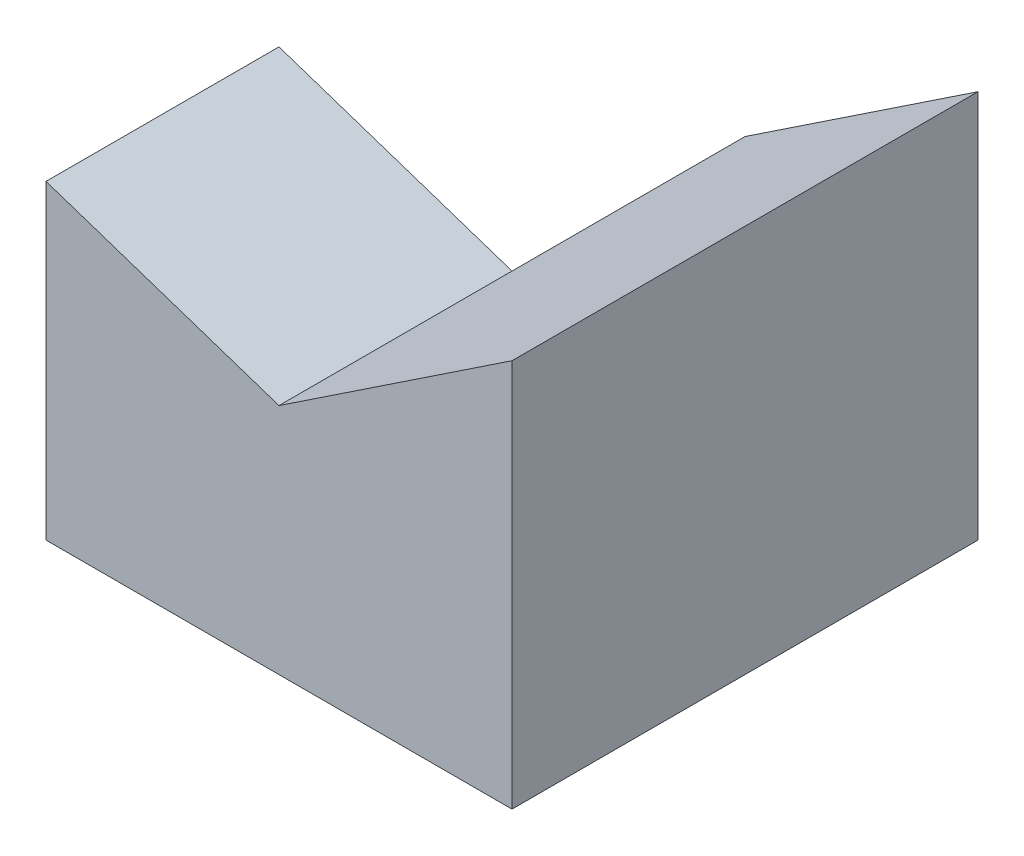
ISO-10303-21;
HEADER;
FILE_DESCRIPTION(('STEP AP214'),'2;1');
FILE_NAME('part.step','',(''),(''),'','','');
FILE_SCHEMA(('AUTOMOTIVE_DESIGN { 1 0 10303 214 1 1 1 1 }'));
ENDSEC;
DATA;
#1=APPLICATION_CONTEXT('core data for automotive mechanical design processes');
#2=APPLICATION_PROTOCOL_DEFINITION('international standard','automotive_design',2000,#1);
#3=PRODUCT_CONTEXT('',#1,'mechanical');
#4=PRODUCT('Part','Part','',(#3));
#5=PRODUCT_RELATED_PRODUCT_CATEGORY('part','',(#4));
#6=PRODUCT_DEFINITION_FORMATION('','',#4);
#7=PRODUCT_DEFINITION_CONTEXT('part definition',#1,'design');
#8=PRODUCT_DEFINITION('design','',#6,#7);
#9=PRODUCT_DEFINITION_SHAPE('','',#8);
#10=(LENGTH_UNIT() NAMED_UNIT(*) SI_UNIT(.MILLI.,.METRE.));
#11=(NAMED_UNIT(*) PLANE_ANGLE_UNIT() SI_UNIT($,.RADIAN.));
#12=(NAMED_UNIT(*) SI_UNIT($,.STERADIAN.) SOLID_ANGLE_UNIT());
#13=UNCERTAINTY_MEASURE_WITH_UNIT(LENGTH_MEASURE(1.E-05),#10,'distance_accuracy_value','');
#14=(GEOMETRIC_REPRESENTATION_CONTEXT(3) GLOBAL_UNCERTAINTY_ASSIGNED_CONTEXT((#13)) GLOBAL_UNIT_ASSIGNED_CONTEXT((#10,
#11,#12)) REPRESENTATION_CONTEXT('',''));
#15=CARTESIAN_POINT('',(0.,0.,0.));
#16=DIRECTION('',(0.,0.,1.));
#17=DIRECTION('',(1.,0.,0.));
#18=AXIS2_PLACEMENT_3D('',#15,#16,#17);
#19=CARTESIAN_POINT('',(-3.,5.,3.));
#20=DIRECTION('',(1.,0.,0.));
#21=DIRECTION('',(0.,0.,-1.));
#22=AXIS2_PLACEMENT_3D('',#19,#20,#21);
#23=PLANE('',#22);
#24=DIRECTION('',(0.,1.,0.));
#25=VECTOR('',#24,1.);
#26=CARTESIAN_POINT('',(-3.,0.,0.));
#27=LINE('',#26,#25);
#28=CARTESIAN_POINT('',(-3.,0.,0.));
#29=VERTEX_POINT('',#28);
#30=CARTESIAN_POINT('',(-3.,4.,0.));
#31=VERTEX_POINT('',#30);
#32=EDGE_CURVE('E80',#29,#31,#27,.T.);
#33=ORIENTED_EDGE('',*,*,#32,.F.);
#34=DIRECTION('',(0.,0.,1.));
#35=VECTOR('',#34,1.);
#36=CARTESIAN_POINT('',(-3.,0.,3.));
#37=LINE('',#36,#35);
#38=CARTESIAN_POINT('',(-3.,0.,3.));
#39=VERTEX_POINT('',#38);
#40=EDGE_CURVE('E73',#29,#39,#37,.T.);
#41=ORIENTED_EDGE('',*,*,#40,.T.);
#42=DIRECTION('',(0.,-1.,0.));
#43=VECTOR('',#42,1.);
#44=CARTESIAN_POINT('',(-3.,5.,3.));
#45=LINE('',#44,#43);
#46=CARTESIAN_POINT('',(-3.,4.,3.));
#47=VERTEX_POINT('',#46);
#48=EDGE_CURVE('E77',#47,#39,#45,.T.);
#49=ORIENTED_EDGE('',*,*,#48,.F.);
#50=DIRECTION('',(0.,0.,1.));
#51=VECTOR('',#50,1.);
#52=CARTESIAN_POINT('',(-3.,4.,-10.5));
#53=LINE('',#52,#51);
#54=EDGE_CURVE('E121',#31,#47,#53,.T.);
#55=ORIENTED_EDGE('',*,*,#54,.F.);
#56=EDGE_LOOP('',(#33,#41,#49,#55));
#57=FACE_BOUND('',#56,.T.);
#58=ADVANCED_FACE('F33',(#57),#23,.F.);
#59=CARTESIAN_POINT('',(0.9,2.7,-10.5));
#60=DIRECTION('',(0.316227766016838,0.948683298050514,0.));
#61=DIRECTION('',(-0.948683298050514,0.316227766016838,0.));
#62=AXIS2_PLACEMENT_3D('',#59,#60,#61);
#63=PLANE('',#62);
#64=DIRECTION('',(0.,0.,1.));
#65=VECTOR('',#64,1.);
#66=CARTESIAN_POINT('',(0.,3.,-10.5));
#67=LINE('',#66,#65);
#68=CARTESIAN_POINT('',(0.,3.,0.));
#69=VERTEX_POINT('',#68);
#70=CARTESIAN_POINT('',(0.,3.,3.));
#71=VERTEX_POINT('',#70);
#72=EDGE_CURVE('E124',#69,#71,#67,.T.);
#73=ORIENTED_EDGE('',*,*,#72,.F.);
#74=DIRECTION('',(-0.948683298050514,0.316227766016838,0.));
#75=VECTOR('',#74,1.);
#76=CARTESIAN_POINT('',(0.9,2.7,0.));
#77=LINE('',#76,#75);
#78=EDGE_CURVE('E11',#69,#31,#77,.T.);
#79=ORIENTED_EDGE('',*,*,#78,.T.);
#80=ORIENTED_EDGE('',*,*,#54,.T.);
#81=DIRECTION('',(-0.948683298050514,0.316227766016838,0.));
#82=VECTOR('',#81,1.);
#83=CARTESIAN_POINT('',(0.9,2.7,3.));
#84=LINE('',#83,#82);
#85=EDGE_CURVE('E93',#71,#47,#84,.T.);
#86=ORIENTED_EDGE('',*,*,#85,.F.);
#87=EDGE_LOOP('',(#73,#79,#80,#86));
#88=FACE_BOUND('',#87,.T.);
#89=ADVANCED_FACE('F155',(#88),#63,.T.);
#90=CARTESIAN_POINT('',(3.,5.,3.));
#91=DIRECTION('',(-1.,0.,0.));
#92=DIRECTION('',(0.,0.,1.));
#93=AXIS2_PLACEMENT_3D('',#90,#91,#92);
#94=PLANE('',#93);
#95=DIRECTION('',(0.,0.,-1.));
#96=VECTOR('',#95,1.);
#97=CARTESIAN_POINT('',(3.,0.,3.));
#98=LINE('',#97,#96);
#99=CARTESIAN_POINT('',(3.,0.,3.));
#100=VERTEX_POINT('',#99);
#101=CARTESIAN_POINT('',(3.,0.,-3.));
#102=VERTEX_POINT('',#101);
#103=EDGE_CURVE('E99',#100,#102,#98,.T.);
#104=ORIENTED_EDGE('',*,*,#103,.T.);
#105=DIRECTION('',(0.,-1.,0.));
#106=VECTOR('',#105,1.);
#107=CARTESIAN_POINT('',(3.,5.,-3.));
#108=LINE('',#107,#106);
#109=CARTESIAN_POINT('',(3.,5.,-3.));
#110=VERTEX_POINT('',#109);
#111=EDGE_CURVE('E41',#110,#102,#108,.T.);
#112=ORIENTED_EDGE('',*,*,#111,.F.);
#113=DIRECTION('',(0.,0.,-1.));
#114=VECTOR('',#113,1.);
#115=CARTESIAN_POINT('',(3.,5.,3.));
#116=LINE('',#115,#114);
#117=CARTESIAN_POINT('',(3.,5.,3.));
#118=VERTEX_POINT('',#117);
#119=EDGE_CURVE('E100',#118,#110,#116,.T.);
#120=ORIENTED_EDGE('',*,*,#119,.F.);
#121=DIRECTION('',(0.,-1.,0.));
#122=VECTOR('',#121,1.);
#123=CARTESIAN_POINT('',(3.,5.,3.));
#124=LINE('',#123,#122);
#125=EDGE_CURVE('E94',#118,#100,#124,.T.);
#126=ORIENTED_EDGE('',*,*,#125,.T.);
#127=EDGE_LOOP('',(#104,#112,#120,#126));
#128=FACE_BOUND('',#127,.T.);
#129=ADVANCED_FACE('F35',(#128),#94,.F.);
#130=CARTESIAN_POINT('',(-3.,5.,-3.));
#131=DIRECTION('',(0.,0.,1.));
#132=DIRECTION('',(1.,0.,0.));
#133=AXIS2_PLACEMENT_3D('',#130,#131,#132);
#134=PLANE('',#133);
#135=DIRECTION('',(-1.,0.,0.));
#136=VECTOR('',#135,1.);
#137=CARTESIAN_POINT('',(-3.,0.,-3.));
#138=LINE('',#137,#136);
#139=CARTESIAN_POINT('',(-3.,0.,-3.));
#140=VERTEX_POINT('',#139);
#141=EDGE_CURVE('E85',#102,#140,#138,.T.);
#142=ORIENTED_EDGE('',*,*,#141,.T.);
#143=DIRECTION('',(-0.707106781186548,-0.707106781186548,0.));
#144=VECTOR('',#143,1.);
#145=CARTESIAN_POINT('',(0.,3.,-3.));
#146=LINE('',#145,#144);
#147=CARTESIAN_POINT('',(0.,3.,-3.));
#148=VERTEX_POINT('',#147);
#149=EDGE_CURVE('E129',#148,#140,#146,.T.);
#150=ORIENTED_EDGE('',*,*,#149,.F.);
#151=DIRECTION('',(0.832050294337844,0.554700196225229,0.));
#152=VECTOR('',#151,1.);
#153=CARTESIAN_POINT('',(-1.15384615384615,2.23076923076923,-3.));
#154=LINE('',#153,#152);
#155=EDGE_CURVE('E114',#148,#110,#154,.T.);
#156=ORIENTED_EDGE('',*,*,#155,.T.);
#157=ORIENTED_EDGE('',*,*,#111,.T.);
#158=EDGE_LOOP('',(#142,#150,#156,#157));
#159=FACE_BOUND('',#158,.T.);
#160=ADVANCED_FACE('F110',(#159),#134,.F.);
#161=CARTESIAN_POINT('',(-3.,5.,3.));
#162=DIRECTION('',(0.,0.,-1.));
#163=DIRECTION('',(-1.,0.,0.));
#164=AXIS2_PLACEMENT_3D('',#161,#162,#163);
#165=PLANE('',#164);
#166=ORIENTED_EDGE('',*,*,#125,.F.);
#167=DIRECTION('',(0.832050294337844,0.554700196225229,0.));
#168=VECTOR('',#167,1.);
#169=CARTESIAN_POINT('',(-1.38461538461538,2.07692307692308,3.));
#170=LINE('',#169,#168);
#171=EDGE_CURVE('E57',#71,#118,#170,.T.);
#172=ORIENTED_EDGE('',*,*,#171,.F.);
#173=ORIENTED_EDGE('',*,*,#85,.T.);
#174=ORIENTED_EDGE('',*,*,#48,.T.);
#175=DIRECTION('',(1.,0.,0.));
#176=VECTOR('',#175,1.);
#177=CARTESIAN_POINT('',(-3.,0.,3.));
#178=LINE('',#177,#176);
#179=EDGE_CURVE('E90',#39,#100,#178,.T.);
#180=ORIENTED_EDGE('',*,*,#179,.T.);
#181=EDGE_LOOP('',(#166,#172,#173,#174,#180));
#182=FACE_BOUND('',#181,.T.);
#183=ADVANCED_FACE('F89',(#182),#165,.F.);
#184=CARTESIAN_POINT('',(0.,0.,0.));
#185=DIRECTION('',(0.,-1.,0.));
#186=DIRECTION('',(0.,0.,-1.));
#187=AXIS2_PLACEMENT_3D('',#184,#185,#186);
#188=PLANE('',#187);
#189=ORIENTED_EDGE('',*,*,#103,.F.);
#190=ORIENTED_EDGE('',*,*,#179,.F.);
#191=ORIENTED_EDGE('',*,*,#40,.F.);
#192=EDGE_CURVE('E84',#140,#29,#37,.T.);
#193=ORIENTED_EDGE('',*,*,#192,.F.);
#194=ORIENTED_EDGE('',*,*,#141,.F.);
#195=EDGE_LOOP('',(#189,#190,#191,#193,#194));
#196=FACE_BOUND('',#195,.T.);
#197=ADVANCED_FACE('F97',(#196),#188,.T.);
#198=CARTESIAN_POINT('',(-1.38461538461538,2.07692307692308,-10.5));
#199=DIRECTION('',(0.554700196225229,-0.832050294337844,0.));
#200=DIRECTION('',(0.832050294337844,0.554700196225229,0.));
#201=AXIS2_PLACEMENT_3D('',#198,#199,#200);
#202=PLANE('',#201);
#203=EDGE_CURVE('E118',#148,#69,#67,.T.);
#204=ORIENTED_EDGE('',*,*,#203,.T.);
#205=ORIENTED_EDGE('',*,*,#72,.T.);
#206=ORIENTED_EDGE('',*,*,#171,.T.);
#207=ORIENTED_EDGE('',*,*,#119,.T.);
#208=ORIENTED_EDGE('',*,*,#155,.F.);
#209=EDGE_LOOP('',(#204,#205,#206,#207,#208));
#210=FACE_BOUND('',#209,.T.);
#211=ADVANCED_FACE('F144',(#210),#202,.F.);
#212=CARTESIAN_POINT('',(0.,3.,0.));
#213=DIRECTION('',(0.707106781186547,-0.707106781186547,0.));
#214=DIRECTION('',(0.707106781186548,0.707106781186548,0.));
#215=AXIS2_PLACEMENT_3D('',#212,#213,#214);
#216=PLANE('',#215);
#217=ORIENTED_EDGE('',*,*,#149,.T.);
#218=ORIENTED_EDGE('',*,*,#192,.T.);
#219=DIRECTION('',(-0.707106781186548,-0.707106781186548,0.));
#220=VECTOR('',#219,1.);
#221=CARTESIAN_POINT('',(0.,3.,0.));
#222=LINE('',#221,#220);
#223=EDGE_CURVE('E48',#69,#29,#222,.T.);
#224=ORIENTED_EDGE('',*,*,#223,.F.);
#225=ORIENTED_EDGE('',*,*,#203,.F.);
#226=EDGE_LOOP('',(#217,#218,#224,#225));
#227=FACE_BOUND('',#226,.T.);
#228=ADVANCED_FACE('F145',(#227),#216,.F.);
#229=CARTESIAN_POINT('',(0.,0.,0.));
#230=DIRECTION('',(0.,0.,-1.));
#231=DIRECTION('',(-1.,0.,0.));
#232=AXIS2_PLACEMENT_3D('',#229,#230,#231);
#233=PLANE('',#232);
#234=ORIENTED_EDGE('',*,*,#223,.T.);
#235=ORIENTED_EDGE('',*,*,#32,.T.);
#236=ORIENTED_EDGE('',*,*,#78,.F.);
#237=EDGE_LOOP('',(#234,#235,#236));
#238=FACE_BOUND('',#237,.T.);
#239=ADVANCED_FACE('F134',(#238),#233,.T.);
#240=CLOSED_SHELL('',(#58,#89,#129,#160,#183,#197,#211,#228,#239));
#241=MANIFOLD_SOLID_BREP('B2',#240);
#242=ADVANCED_BREP_SHAPE_REPRESENTATION('',(#18,#241),#14);
#243=SHAPE_DEFINITION_REPRESENTATION(#9,#242);
ENDSEC;
END-ISO-10303-21;
